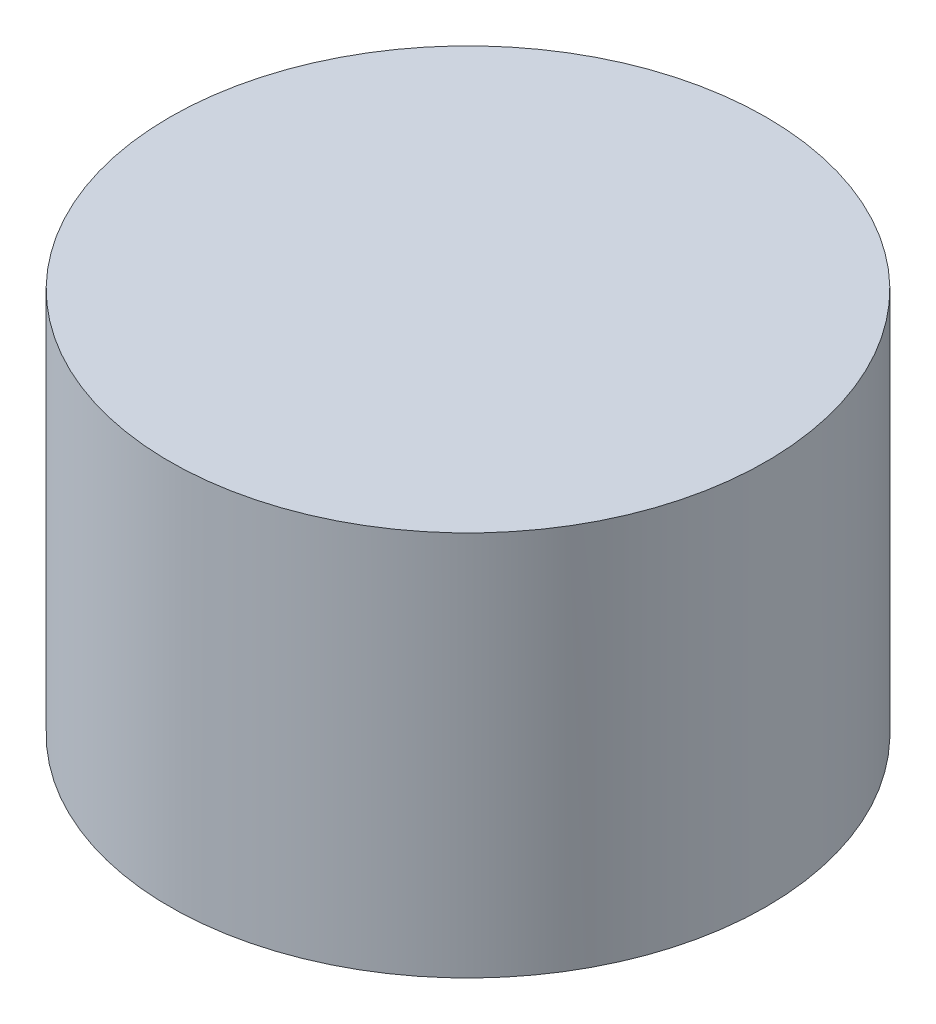
ISO-10303-21;
HEADER;
FILE_DESCRIPTION(('STEP AP214'),'2;1');
FILE_NAME('part.step','',(''),(''),'','','');
FILE_SCHEMA(('AUTOMOTIVE_DESIGN { 1 0 10303 214 1 1 1 1 }'));
ENDSEC;
DATA;
#1=APPLICATION_CONTEXT('core data for automotive mechanical design processes');
#2=APPLICATION_PROTOCOL_DEFINITION('international standard','automotive_design',2000,#1);
#3=PRODUCT_CONTEXT('',#1,'mechanical');
#4=PRODUCT('Part','Part','',(#3));
#5=PRODUCT_RELATED_PRODUCT_CATEGORY('part','',(#4));
#6=PRODUCT_DEFINITION_FORMATION('','',#4);
#7=PRODUCT_DEFINITION_CONTEXT('part definition',#1,'design');
#8=PRODUCT_DEFINITION('design','',#6,#7);
#9=PRODUCT_DEFINITION_SHAPE('','',#8);
#10=(LENGTH_UNIT() NAMED_UNIT(*) SI_UNIT(.MILLI.,.METRE.));
#11=(NAMED_UNIT(*) PLANE_ANGLE_UNIT() SI_UNIT($,.RADIAN.));
#12=(NAMED_UNIT(*) SI_UNIT($,.STERADIAN.) SOLID_ANGLE_UNIT());
#13=UNCERTAINTY_MEASURE_WITH_UNIT(LENGTH_MEASURE(1.E-05),#10,'distance_accuracy_value','');
#14=(GEOMETRIC_REPRESENTATION_CONTEXT(3) GLOBAL_UNCERTAINTY_ASSIGNED_CONTEXT((#13)) GLOBAL_UNIT_ASSIGNED_CONTEXT((#10,
#11,#12)) REPRESENTATION_CONTEXT('',''));
#15=CARTESIAN_POINT('',(0.,0.,0.));
#16=DIRECTION('',(0.,0.,1.));
#17=DIRECTION('',(1.,0.,0.));
#18=AXIS2_PLACEMENT_3D('',#15,#16,#17);
#19=CARTESIAN_POINT('',(-96.1822716477026,72.6305305649318,75.));
#20=DIRECTION('',(0.,-1.,0.));
#21=DIRECTION('',(0.,0.,-1.));
#22=AXIS2_PLACEMENT_3D('',#19,#20,#21);
#23=PLANE('',#22);
#24=CARTESIAN_POINT('',(-32.2468321183409,72.6305305649318,-20.8954465942453));
#25=DIRECTION('',(0.,-1.,0.));
#26=DIRECTION('',(0.,0.,-1.));
#27=AXIS2_PLACEMENT_3D('',#24,#25,#26);
#28=CIRCLE('',#27,39.);
#29=CARTESIAN_POINT('',(-32.2468321183409,72.6305305649318,-59.8954465942453));
#30=VERTEX_POINT('',#29);
#31=EDGE_CURVE('E10',#30,#30,#28,.F.);
#32=ORIENTED_EDGE('',*,*,#31,.T.);
#33=EDGE_LOOP('',(#32));
#34=FACE_BOUND('',#33,.T.);
#35=ADVANCED_FACE('F31',(#34),#23,.F.);
#36=CARTESIAN_POINT('',(-32.2468321183409,22.2320708634522,-20.8954465942453));
#37=DIRECTION('',(0.,1.,0.));
#38=DIRECTION('',(-1.,0.,0.));
#39=AXIS2_PLACEMENT_3D('',#36,#37,#38);
#40=PLANE('',#39);
#41=CARTESIAN_POINT('',(-32.2468321183409,22.2320708634522,-20.8954465942453));
#42=DIRECTION('',(0.,1.,0.));
#43=DIRECTION('',(-1.,0.,0.));
#44=AXIS2_PLACEMENT_3D('',#41,#42,#43);
#45=CIRCLE('',#44,39.);
#46=CARTESIAN_POINT('',(-71.2468321183409,22.2320708634522,-20.8954465942453));
#47=VERTEX_POINT('',#46);
#48=EDGE_CURVE('E37',#47,#47,#45,.T.);
#49=ORIENTED_EDGE('',*,*,#48,.F.);
#50=EDGE_LOOP('',(#49));
#51=FACE_BOUND('',#50,.T.);
#52=ADVANCED_FACE('F46',(#51),#40,.F.);
#53=CARTESIAN_POINT('',(-32.246832118341,111.232070863452,-20.8954465942453));
#54=DIRECTION('',(0.,1.,0.));
#55=DIRECTION('',(-1.,0.,0.));
#56=AXIS2_PLACEMENT_3D('',#53,#54,#55);
#57=CYLINDRICAL_SURFACE('',#56,39.);
#58=ORIENTED_EDGE('',*,*,#48,.T.);
#59=EDGE_LOOP('',(#58));
#60=FACE_BOUND('',#59,.T.);
#61=ORIENTED_EDGE('',*,*,#31,.F.);
#62=EDGE_LOOP('',(#61));
#63=FACE_BOUND('',#62,.T.);
#64=ADVANCED_FACE('F43',(#60,#63),#57,.T.);
#65=CLOSED_SHELL('',(#35,#52,#64));
#66=MANIFOLD_SOLID_BREP('B2',#65);
#67=ADVANCED_BREP_SHAPE_REPRESENTATION('',(#18,#66),#14);
#68=SHAPE_DEFINITION_REPRESENTATION(#9,#67);
ENDSEC;
END-ISO-10303-21;
